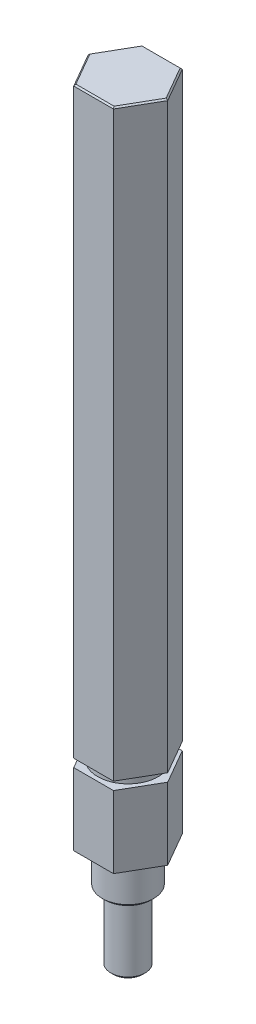
ISO-10303-21;
HEADER;
FILE_DESCRIPTION(('STEP AP214'),'2;1');
FILE_NAME('part.step','',(''),(''),'','','');
FILE_SCHEMA(('AUTOMOTIVE_DESIGN { 1 0 10303 214 1 1 1 1 }'));
ENDSEC;
DATA;
#1=APPLICATION_CONTEXT('core data for automotive mechanical design processes');
#2=APPLICATION_PROTOCOL_DEFINITION('international standard','automotive_design',2000,#1);
#3=PRODUCT_CONTEXT('',#1,'mechanical');
#4=PRODUCT('Part','Part','',(#3));
#5=PRODUCT_RELATED_PRODUCT_CATEGORY('part','',(#4));
#6=PRODUCT_DEFINITION_FORMATION('','',#4);
#7=PRODUCT_DEFINITION_CONTEXT('part definition',#1,'design');
#8=PRODUCT_DEFINITION('design','',#6,#7);
#9=PRODUCT_DEFINITION_SHAPE('','',#8);
#10=(LENGTH_UNIT() NAMED_UNIT(*) SI_UNIT(.MILLI.,.METRE.));
#11=(NAMED_UNIT(*) PLANE_ANGLE_UNIT() SI_UNIT($,.RADIAN.));
#12=(NAMED_UNIT(*) SI_UNIT($,.STERADIAN.) SOLID_ANGLE_UNIT());
#13=UNCERTAINTY_MEASURE_WITH_UNIT(LENGTH_MEASURE(1.E-05),#10,'distance_accuracy_value','');
#14=(GEOMETRIC_REPRESENTATION_CONTEXT(3) GLOBAL_UNCERTAINTY_ASSIGNED_CONTEXT((#13)) GLOBAL_UNIT_ASSIGNED_CONTEXT((#10,
#11,#12)) REPRESENTATION_CONTEXT('',''));
#15=CARTESIAN_POINT('',(0.,0.,0.));
#16=DIRECTION('',(0.,0.,1.));
#17=DIRECTION('',(1.,0.,0.));
#18=AXIS2_PLACEMENT_3D('',#15,#16,#17);
#19=CARTESIAN_POINT('',(-38.3071337161431,-45.212,-16.669011646302));
#20=DIRECTION('',(0.,1.,0.));
#21=DIRECTION('',(0.,0.,1.));
#22=AXIS2_PLACEMENT_3D('',#19,#20,#21);
#23=PLANE('',#22);
#24=CARTESIAN_POINT('',(-38.3071337161431,-45.2119999999923,-16.669011646302));
#25=DIRECTION('',(0.,1.,0.));
#26=DIRECTION('',(0.,0.,1.));
#27=AXIS2_PLACEMENT_3D('',#24,#25,#26);
#28=CIRCLE('',#27,2.65430000009029);
#29=CARTESIAN_POINT('',(-38.3071337161431,-45.2119999999923,-14.0147116462117));
#30=VERTEX_POINT('',#29);
#31=EDGE_CURVE('E20',#30,#30,#28,.T.);
#32=ORIENTED_EDGE('',*,*,#31,.F.);
#33=EDGE_LOOP('',(#32));
#34=FACE_BOUND('',#33,.T.);
#35=ADVANCED_FACE('F17',(#34),#23,.F.);
#36=CARTESIAN_POINT('',(-38.3071337161431,-44.704000000138,-16.669011646302));
#37=DIRECTION('',(0.,1.,0.));
#38=DIRECTION('',(0.,0.,1.));
#39=AXIS2_PLACEMENT_3D('',#36,#37,#38);
#40=CONICAL_SURFACE('',#39,3.16229999994458,0.785398163397448);
#41=CARTESIAN_POINT('',(-38.3071337161431,-44.704,-16.669011646302));
#42=DIRECTION('',(0.,1.,0.));
#43=DIRECTION('',(0.,0.,1.));
#44=AXIS2_PLACEMENT_3D('',#41,#42,#43);
#45=CIRCLE('',#44,3.1623);
#46=CARTESIAN_POINT('',(-38.3071337161431,-44.704,-13.506711646302));
#47=VERTEX_POINT('',#46);
#48=EDGE_CURVE('E154',#47,#47,#45,.T.);
#49=ORIENTED_EDGE('',*,*,#48,.F.);
#50=EDGE_LOOP('',(#49));
#51=FACE_BOUND('',#50,.T.);
#52=ORIENTED_EDGE('',*,*,#31,.T.);
#53=EDGE_LOOP('',(#52));
#54=FACE_BOUND('',#53,.T.);
#55=ADVANCED_FACE('F190',(#51,#54),#40,.T.);
#56=CARTESIAN_POINT('',(-38.3071337161431,-45.212,-16.669011646302));
#57=DIRECTION('',(0.,1.,0.));
#58=DIRECTION('',(0.,0.,1.));
#59=AXIS2_PLACEMENT_3D('',#56,#57,#58);
#60=CYLINDRICAL_SURFACE('',#59,3.1623);
#61=CARTESIAN_POINT('',(-38.3071337161431,-32.512,-16.669011646302));
#62=DIRECTION('',(0.,1.,0.));
#63=DIRECTION('',(0.,0.,1.));
#64=AXIS2_PLACEMENT_3D('',#61,#62,#63);
#65=CIRCLE('',#64,3.1623);
#66=CARTESIAN_POINT('',(-38.3071337161431,-32.512,-13.506711646302));
#67=VERTEX_POINT('',#66);
#68=EDGE_CURVE('E157',#67,#67,#65,.F.);
#69=ORIENTED_EDGE('',*,*,#68,.T.);
#70=EDGE_LOOP('',(#69));
#71=FACE_BOUND('',#70,.T.);
#72=ORIENTED_EDGE('',*,*,#48,.T.);
#73=EDGE_LOOP('',(#72));
#74=FACE_BOUND('',#73,.T.);
#75=ADVANCED_FACE('F174',(#71,#74),#60,.T.);
#76=CARTESIAN_POINT('',(-38.3071337161431,-32.512,-16.669011646302));
#77=DIRECTION('',(0.,1.,0.));
#78=DIRECTION('',(0.,0.,1.));
#79=AXIS2_PLACEMENT_3D('',#76,#77,#78);
#80=PLANE('',#79);
#81=CARTESIAN_POINT('',(-38.3071337161431,-32.511999999997,-16.669011646302));
#82=DIRECTION('',(0.,1.,0.));
#83=DIRECTION('',(0.,0.,1.));
#84=AXIS2_PLACEMENT_3D('',#81,#82,#83);
#85=CIRCLE('',#84,4.24179999994759);
#86=CARTESIAN_POINT('',(-38.3071337161431,-32.511999999997,-12.4272116463544));
#87=VERTEX_POINT('',#86);
#88=EDGE_CURVE('E153',#87,#87,#85,.T.);
#89=ORIENTED_EDGE('',*,*,#88,.F.);
#90=EDGE_LOOP('',(#89));
#91=FACE_BOUND('',#90,.T.);
#92=ORIENTED_EDGE('',*,*,#68,.F.);
#93=EDGE_LOOP('',(#92));
#94=FACE_BOUND('',#93,.T.);
#95=ADVANCED_FACE('F177',(#91,#94),#80,.F.);
#96=CARTESIAN_POINT('',(-38.3071337161431,-32.0039999999722,-16.669011646302));
#97=DIRECTION('',(0.,1.,0.));
#98=DIRECTION('',(0.,0.,1.));
#99=AXIS2_PLACEMENT_3D('',#96,#97,#98);
#100=CONICAL_SURFACE('',#99,4.74979999991557,0.7853981633415);
#101=CARTESIAN_POINT('',(-38.3071337161431,-32.004,-16.669011646302));
#102=DIRECTION('',(0.,1.,0.));
#103=DIRECTION('',(0.,0.,1.));
#104=AXIS2_PLACEMENT_3D('',#101,#102,#103);
#105=CIRCLE('',#104,4.7498);
#106=CARTESIAN_POINT('',(-38.3071337161431,-32.004,-11.919211646302));
#107=VERTEX_POINT('',#106);
#108=EDGE_CURVE('E150',#107,#107,#105,.T.);
#109=ORIENTED_EDGE('',*,*,#108,.F.);
#110=EDGE_LOOP('',(#109));
#111=FACE_BOUND('',#110,.T.);
#112=ORIENTED_EDGE('',*,*,#88,.T.);
#113=EDGE_LOOP('',(#112));
#114=FACE_BOUND('',#113,.T.);
#115=ADVANCED_FACE('F179',(#111,#114),#100,.T.);
#116=CARTESIAN_POINT('',(-38.3071337161431,-32.512,-16.669011646302));
#117=DIRECTION('',(0.,1.,0.));
#118=DIRECTION('',(0.,0.,1.));
#119=AXIS2_PLACEMENT_3D('',#116,#117,#118);
#120=CYLINDRICAL_SURFACE('',#119,4.7498);
#121=CARTESIAN_POINT('',(-38.3071337161431,-25.4,-16.669011646302));
#122=DIRECTION('',(0.,1.,0.));
#123=DIRECTION('',(0.,0.,1.));
#124=AXIS2_PLACEMENT_3D('',#121,#122,#123);
#125=CIRCLE('',#124,4.7498);
#126=CARTESIAN_POINT('',(-38.3071337161431,-25.4,-11.919211646302));
#127=VERTEX_POINT('',#126);
#128=EDGE_CURVE('E132',#127,#127,#125,.F.);
#129=ORIENTED_EDGE('',*,*,#128,.T.);
#130=EDGE_LOOP('',(#129));
#131=FACE_BOUND('',#130,.T.);
#132=ORIENTED_EDGE('',*,*,#108,.T.);
#133=EDGE_LOOP('',(#132));
#134=FACE_BOUND('',#133,.T.);
#135=ADVANCED_FACE('F187',(#131,#134),#120,.T.);
#136=CARTESIAN_POINT('',(-38.3071337161431,-25.4,-3.96901164630201));
#137=DIRECTION('',(0.,1.,0.));
#138=DIRECTION('',(0.,0.,1.));
#139=AXIS2_PLACEMENT_3D('',#136,#137,#138);
#140=PLANE('',#139);
#141=DIRECTION('',(-0.5,0.,0.866025403784439));
#142=VECTOR('',#141,1.);
#143=CARTESIAN_POINT('',(-41.9733079254973,-25.4,-23.019011646302));
#144=LINE('',#143,#142);
#145=CARTESIAN_POINT('',(-41.9733079254973,-25.4,-23.019011646302));
#146=VERTEX_POINT('',#145);
#147=CARTESIAN_POINT('',(-45.6394821348514,-25.4,-16.669011646302));
#148=VERTEX_POINT('',#147);
#149=EDGE_CURVE('E124',#146,#148,#144,.T.);
#150=ORIENTED_EDGE('',*,*,#149,.F.);
#151=DIRECTION('',(-1.,0.,0.));
#152=VECTOR('',#151,1.);
#153=CARTESIAN_POINT('',(-34.640959506789,-25.4,-23.019011646302));
#154=LINE('',#153,#152);
#155=CARTESIAN_POINT('',(-34.640959506789,-25.4,-23.019011646302));
#156=VERTEX_POINT('',#155);
#157=EDGE_CURVE('E121',#156,#146,#154,.T.);
#158=ORIENTED_EDGE('',*,*,#157,.F.);
#159=DIRECTION('',(-0.5,0.,-0.866025403784439));
#160=VECTOR('',#159,1.);
#161=CARTESIAN_POINT('',(-30.9747852974349,-25.4,-16.669011646302));
#162=LINE('',#161,#160);
#163=CARTESIAN_POINT('',(-30.9747852974349,-25.4,-16.669011646302));
#164=VERTEX_POINT('',#163);
#165=EDGE_CURVE('E141',#164,#156,#162,.T.);
#166=ORIENTED_EDGE('',*,*,#165,.F.);
#167=DIRECTION('',(0.500000000000001,0.,-0.866025403784438));
#168=VECTOR('',#167,1.);
#169=CARTESIAN_POINT('',(-34.640959506789,-25.4,-10.319011646302));
#170=LINE('',#169,#168);
#171=CARTESIAN_POINT('',(-34.640959506789,-25.4,-10.319011646302));
#172=VERTEX_POINT('',#171);
#173=EDGE_CURVE('E478',#172,#164,#170,.T.);
#174=ORIENTED_EDGE('',*,*,#173,.F.);
#175=DIRECTION('',(1.,0.,0.));
#176=VECTOR('',#175,1.);
#177=CARTESIAN_POINT('',(-41.9733079254973,-25.4,-10.319011646302));
#178=LINE('',#177,#176);
#179=CARTESIAN_POINT('',(-41.9733079254973,-25.4,-10.319011646302));
#180=VERTEX_POINT('',#179);
#181=EDGE_CURVE('E483',#180,#172,#178,.T.);
#182=ORIENTED_EDGE('',*,*,#181,.F.);
#183=DIRECTION('',(0.5,0.,0.866025403784439));
#184=VECTOR('',#183,1.);
#185=CARTESIAN_POINT('',(-45.6394821348514,-25.4,-16.669011646302));
#186=LINE('',#185,#184);
#187=EDGE_CURVE('E129',#148,#180,#186,.T.);
#188=ORIENTED_EDGE('',*,*,#187,.F.);
#189=EDGE_LOOP('',(#150,#158,#166,#174,#182,#188));
#190=FACE_BOUND('',#189,.T.);
#191=ORIENTED_EDGE('',*,*,#128,.F.);
#192=EDGE_LOOP('',(#191));
#193=FACE_BOUND('',#192,.T.);
#194=ADVANCED_FACE('F126',(#190,#193),#140,.F.);
#195=CARTESIAN_POINT('',(-41.9733079254973,-25.4,-23.019011646302));
#196=DIRECTION('',(-0.866025403784439,0.,-0.5));
#197=DIRECTION('',(-0.5,0.,0.866025403784439));
#198=AXIS2_PLACEMENT_3D('',#195,#196,#197);
#199=PLANE('',#198);
#200=ORIENTED_EDGE('',*,*,#149,.T.);
#201=DIRECTION('',(0.,1.,0.));
#202=VECTOR('',#201,1.);
#203=CARTESIAN_POINT('',(-45.6394821348514,-25.4,-16.669011646302));
#204=LINE('',#203,#202);
#205=CARTESIAN_POINT('',(-45.6394821348514,-12.1158,-16.669011646302));
#206=VERTEX_POINT('',#205);
#207=EDGE_CURVE('E489',#206,#148,#204,.F.);
#208=ORIENTED_EDGE('',*,*,#207,.F.);
#209=DIRECTION('',(0.5,0.,-0.866025403784439));
#210=VECTOR('',#209,1.);
#211=CARTESIAN_POINT('',(-45.6394821348514,-12.1158,-16.669011646302));
#212=LINE('',#211,#210);
#213=CARTESIAN_POINT('',(-41.9733079254973,-12.1158,-23.019011646302));
#214=VERTEX_POINT('',#213);
#215=EDGE_CURVE('E138',#206,#214,#212,.T.);
#216=ORIENTED_EDGE('',*,*,#215,.T.);
#217=DIRECTION('',(0.,1.,0.));
#218=VECTOR('',#217,1.);
#219=CARTESIAN_POINT('',(-41.9733079254973,-25.4,-23.019011646302));
#220=LINE('',#219,#218);
#221=EDGE_CURVE('E135',#146,#214,#220,.T.);
#222=ORIENTED_EDGE('',*,*,#221,.F.);
#223=EDGE_LOOP('',(#200,#208,#216,#222));
#224=FACE_BOUND('',#223,.T.);
#225=ADVANCED_FACE('F136',(#224),#199,.T.);
#226=CARTESIAN_POINT('',(-34.640959506789,-25.4,-23.019011646302));
#227=DIRECTION('',(0.,0.,-1.));
#228=DIRECTION('',(-1.,0.,0.));
#229=AXIS2_PLACEMENT_3D('',#226,#227,#228);
#230=PLANE('',#229);
#231=ORIENTED_EDGE('',*,*,#157,.T.);
#232=ORIENTED_EDGE('',*,*,#221,.T.);
#233=DIRECTION('',(1.,0.,0.));
#234=VECTOR('',#233,1.);
#235=CARTESIAN_POINT('',(-21.7881364409388,-12.1158,-23.019011646302));
#236=LINE('',#235,#234);
#237=CARTESIAN_POINT('',(-34.640959506789,-12.1158,-23.019011646302));
#238=VERTEX_POINT('',#237);
#239=EDGE_CURVE('E500',#214,#238,#236,.T.);
#240=ORIENTED_EDGE('',*,*,#239,.T.);
#241=DIRECTION('',(0.,1.,0.));
#242=VECTOR('',#241,1.);
#243=CARTESIAN_POINT('',(-34.640959506789,-25.4,-23.019011646302));
#244=LINE('',#243,#242);
#245=EDGE_CURVE('E145',#156,#238,#244,.T.);
#246=ORIENTED_EDGE('',*,*,#245,.F.);
#247=EDGE_LOOP('',(#231,#232,#240,#246));
#248=FACE_BOUND('',#247,.T.);
#249=ADVANCED_FACE('F143',(#248),#230,.T.);
#250=CARTESIAN_POINT('',(-30.9747852974349,-25.4,-16.669011646302));
#251=DIRECTION('',(0.866025403784439,0.,-0.5));
#252=DIRECTION('',(-0.5,0.,-0.866025403784439));
#253=AXIS2_PLACEMENT_3D('',#250,#251,#252);
#254=PLANE('',#253);
#255=ORIENTED_EDGE('',*,*,#165,.T.);
#256=ORIENTED_EDGE('',*,*,#245,.T.);
#257=DIRECTION('',(0.5,0.,0.866025403784438));
#258=VECTOR('',#257,1.);
#259=CARTESIAN_POINT('',(-34.640959506789,-12.1158,-23.019011646302));
#260=LINE('',#259,#258);
#261=CARTESIAN_POINT('',(-30.9747852974349,-12.1158,-16.669011646302));
#262=VERTEX_POINT('',#261);
#263=EDGE_CURVE('E502',#238,#262,#260,.T.);
#264=ORIENTED_EDGE('',*,*,#263,.T.);
#265=DIRECTION('',(0.,1.,0.));
#266=VECTOR('',#265,1.);
#267=CARTESIAN_POINT('',(-30.9747852974349,-25.4,-16.669011646302));
#268=LINE('',#267,#266);
#269=EDGE_CURVE('E476',#164,#262,#268,.T.);
#270=ORIENTED_EDGE('',*,*,#269,.F.);
#271=EDGE_LOOP('',(#255,#256,#264,#270));
#272=FACE_BOUND('',#271,.T.);
#273=ADVANCED_FACE('F271',(#272),#254,.T.);
#274=CARTESIAN_POINT('',(-34.640959506789,-25.4,-10.319011646302));
#275=DIRECTION('',(0.866025403784438,0.,0.500000000000001));
#276=DIRECTION('',(0.500000000000001,0.,-0.866025403784438));
#277=AXIS2_PLACEMENT_3D('',#274,#275,#276);
#278=PLANE('',#277);
#279=ORIENTED_EDGE('',*,*,#173,.T.);
#280=ORIENTED_EDGE('',*,*,#269,.T.);
#281=DIRECTION('',(-0.500000000000001,0.,0.866025403784438));
#282=VECTOR('',#281,1.);
#283=CARTESIAN_POINT('',(-30.9747852974349,-12.1158,-16.669011646302));
#284=LINE('',#283,#282);
#285=CARTESIAN_POINT('',(-34.640959506789,-12.1158,-10.319011646302));
#286=VERTEX_POINT('',#285);
#287=EDGE_CURVE('E504',#262,#286,#284,.T.);
#288=ORIENTED_EDGE('',*,*,#287,.T.);
#289=DIRECTION('',(0.,1.,0.));
#290=VECTOR('',#289,1.);
#291=CARTESIAN_POINT('',(-34.640959506789,-25.4,-10.319011646302));
#292=LINE('',#291,#290);
#293=EDGE_CURVE('E486',#172,#286,#292,.T.);
#294=ORIENTED_EDGE('',*,*,#293,.F.);
#295=EDGE_LOOP('',(#279,#280,#288,#294));
#296=FACE_BOUND('',#295,.T.);
#297=ADVANCED_FACE('F267',(#296),#278,.T.);
#298=CARTESIAN_POINT('',(-41.9733079254973,-25.4,-10.319011646302));
#299=DIRECTION('',(0.,0.,1.));
#300=DIRECTION('',(1.,0.,0.));
#301=AXIS2_PLACEMENT_3D('',#298,#299,#300);
#302=PLANE('',#301);
#303=ORIENTED_EDGE('',*,*,#181,.T.);
#304=ORIENTED_EDGE('',*,*,#293,.T.);
#305=DIRECTION('',(1.,0.,0.));
#306=VECTOR('',#305,1.);
#307=CARTESIAN_POINT('',(-21.7881364409388,-12.1158,-10.319011646302));
#308=LINE('',#307,#306);
#309=CARTESIAN_POINT('',(-41.9733079254973,-12.1158,-10.319011646302));
#310=VERTEX_POINT('',#309);
#311=EDGE_CURVE('E506',#286,#310,#308,.F.);
#312=ORIENTED_EDGE('',*,*,#311,.T.);
#313=DIRECTION('',(0.,1.,0.));
#314=VECTOR('',#313,1.);
#315=CARTESIAN_POINT('',(-41.9733079254973,-25.4,-10.319011646302));
#316=LINE('',#315,#314);
#317=EDGE_CURVE('E492',#180,#310,#316,.T.);
#318=ORIENTED_EDGE('',*,*,#317,.F.);
#319=EDGE_LOOP('',(#303,#304,#312,#318));
#320=FACE_BOUND('',#319,.T.);
#321=ADVANCED_FACE('F263',(#320),#302,.T.);
#322=CARTESIAN_POINT('',(-45.6394821348514,-25.4,-16.669011646302));
#323=DIRECTION('',(-0.866025403784439,0.,0.5));
#324=DIRECTION('',(0.5,0.,0.866025403784439));
#325=AXIS2_PLACEMENT_3D('',#322,#323,#324);
#326=PLANE('',#325);
#327=ORIENTED_EDGE('',*,*,#187,.T.);
#328=ORIENTED_EDGE('',*,*,#317,.T.);
#329=DIRECTION('',(-0.5,0.,-0.866025403784438));
#330=VECTOR('',#329,1.);
#331=CARTESIAN_POINT('',(-41.9733079254973,-12.1158,-10.319011646302));
#332=LINE('',#331,#330);
#333=EDGE_CURVE('E508',#310,#206,#332,.T.);
#334=ORIENTED_EDGE('',*,*,#333,.T.);
#335=ORIENTED_EDGE('',*,*,#207,.T.);
#336=EDGE_LOOP('',(#327,#328,#334,#335));
#337=FACE_BOUND('',#336,.T.);
#338=ADVANCED_FACE('F259',(#337),#326,.T.);
#339=CARTESIAN_POINT('',(-38.3071337161451,97.0813400000005,-10.573011646302));
#340=DIRECTION('',(0.,-0.707106781186544,-0.707106781186551));
#341=DIRECTION('',(0.,0.707106781186551,-0.707106781186544));
#342=AXIS2_PLACEMENT_3D('',#339,#340,#341);
#343=PLANE('',#342);
#344=DIRECTION('',(1.,0.,0.));
#345=VECTOR('',#344,1.);
#346=CARTESIAN_POINT('',(-41.9733079254973,96.8273400000005,-10.319011646302));
#347=LINE('',#346,#345);
#348=CARTESIAN_POINT('',(-34.640959506789,96.8273400000005,-10.319011646302));
#349=VERTEX_POINT('',#348);
#350=CARTESIAN_POINT('',(-41.9733079254973,96.8273400000005,-10.319011646302));
#351=VERTEX_POINT('',#350);
#352=EDGE_CURVE('E531',#349,#351,#347,.F.);
#353=ORIENTED_EDGE('',*,*,#352,.F.);
#354=DIRECTION('',(-0.377964473009223,0.654653670707976,-0.654653670707981));
#355=VECTOR('',#354,1.);
#356=CARTESIAN_POINT('',(-34.640959506789,96.8273400000005,-10.319011646302));
#357=LINE('',#356,#355);
#358=CARTESIAN_POINT('',(-34.7876064751632,97.0813400000005,-10.573011646302));
#359=VERTEX_POINT('',#358);
#360=EDGE_CURVE('E495',#349,#359,#357,.T.);
#361=ORIENTED_EDGE('',*,*,#360,.T.);
#362=DIRECTION('',(1.,0.,0.));
#363=VECTOR('',#362,1.);
#364=CARTESIAN_POINT('',(-38.3071337161451,97.0813400000005,-10.573011646302));
#365=LINE('',#364,#363);
#366=CARTESIAN_POINT('',(-41.8266609571231,97.0813400000005,-10.573011646302));
#367=VERTEX_POINT('',#366);
#368=EDGE_CURVE('E518',#367,#359,#365,.T.);
#369=ORIENTED_EDGE('',*,*,#368,.F.);
#370=DIRECTION('',(-0.377964473009255,-0.654653670707976,0.654653670707962));
#371=VECTOR('',#370,1.);
#372=CARTESIAN_POINT('',(-41.8266609571231,97.0813400000005,-10.573011646302));
#373=LINE('',#372,#371);
#374=EDGE_CURVE('E511',#367,#351,#373,.T.);
#375=ORIENTED_EDGE('',*,*,#374,.T.);
#376=EDGE_LOOP('',(#353,#361,#369,#375));
#377=FACE_BOUND('',#376,.T.);
#378=ADVANCED_FACE('F255',(#377),#343,.F.);
#379=CARTESIAN_POINT('',(-33.0278428546734,97.0813400000005,-13.6210116463016));
#380=DIRECTION('',(-0.612372435695796,-0.707106781186546,-0.353553390593275));
#381=DIRECTION('',(0.755928946018453,-0.654653670707979,0.));
#382=AXIS2_PLACEMENT_3D('',#379,#380,#381);
#383=PLANE('',#382);
#384=DIRECTION('',(0.500000000000001,0.,-0.866025403784438));
#385=VECTOR('',#384,1.);
#386=CARTESIAN_POINT('',(-34.7876064751632,97.0813400000005,-10.573011646302));
#387=LINE('',#386,#385);
#388=CARTESIAN_POINT('',(-31.2680792341832,97.0813400000005,-16.669011646302));
#389=VERTEX_POINT('',#388);
#390=EDGE_CURVE('E521',#359,#389,#387,.T.);
#391=ORIENTED_EDGE('',*,*,#390,.F.);
#392=ORIENTED_EDGE('',*,*,#360,.F.);
#393=DIRECTION('',(0.500000000000001,0.,-0.866025403784438));
#394=VECTOR('',#393,1.);
#395=CARTESIAN_POINT('',(-34.640959506789,96.8273400000005,-10.319011646302));
#396=LINE('',#395,#394);
#397=CARTESIAN_POINT('',(-30.9747852974349,96.8273400000005,-16.669011646302));
#398=VERTEX_POINT('',#397);
#399=EDGE_CURVE('E534',#398,#349,#396,.F.);
#400=ORIENTED_EDGE('',*,*,#399,.F.);
#401=DIRECTION('',(0.755928946018445,-0.654653670707988,0.));
#402=VECTOR('',#401,1.);
#403=CARTESIAN_POINT('',(-32.2736584458922,97.952197142858,-16.669011646302));
#404=LINE('',#403,#402);
#405=EDGE_CURVE('E497',#398,#389,#404,.F.);
#406=ORIENTED_EDGE('',*,*,#405,.T.);
#407=EDGE_LOOP('',(#391,#392,#400,#406));
#408=FACE_BOUND('',#407,.T.);
#409=ADVANCED_FACE('F251',(#408),#383,.F.);
#410=CARTESIAN_POINT('',(-33.0278428546739,97.0813400000005,-19.7170116463033));
#411=DIRECTION('',(-0.612372435695803,-0.707106781186538,0.353553390593279));
#412=DIRECTION('',(0.755928946018445,-0.654653670707988,0.));
#413=AXIS2_PLACEMENT_3D('',#410,#411,#412);
#414=PLANE('',#413);
#415=DIRECTION('',(-0.5,0.,-0.866025403784439));
#416=VECTOR('',#415,1.);
#417=CARTESIAN_POINT('',(-31.2680792341832,97.0813400000005,-16.669011646302));
#418=LINE('',#417,#416);
#419=CARTESIAN_POINT('',(-34.7876064751632,97.0813400000005,-22.765011646302));
#420=VERTEX_POINT('',#419);
#421=EDGE_CURVE('E524',#389,#420,#418,.T.);
#422=ORIENTED_EDGE('',*,*,#421,.F.);
#423=ORIENTED_EDGE('',*,*,#405,.F.);
#424=DIRECTION('',(-0.5,0.,-0.866025403784439));
#425=VECTOR('',#424,1.);
#426=CARTESIAN_POINT('',(-30.9747852974349,96.8273400000005,-16.669011646302));
#427=LINE('',#426,#425);
#428=CARTESIAN_POINT('',(-34.640959506789,96.8273400000005,-23.019011646302));
#429=VERTEX_POINT('',#428);
#430=EDGE_CURVE('E540',#429,#398,#427,.F.);
#431=ORIENTED_EDGE('',*,*,#430,.F.);
#432=DIRECTION('',(-0.377964473009211,0.654653670707982,0.654653670707982));
#433=VECTOR('',#432,1.);
#434=CARTESIAN_POINT('',(-34.640959506789,96.8273400000005,-23.019011646302));
#435=LINE('',#434,#433);
#436=EDGE_CURVE('E528',#429,#420,#435,.T.);
#437=ORIENTED_EDGE('',*,*,#436,.T.);
#438=EDGE_LOOP('',(#422,#423,#431,#437));
#439=FACE_BOUND('',#438,.T.);
#440=ADVANCED_FACE('F247',(#439),#414,.F.);
#441=CARTESIAN_POINT('',(-21.7881364409388,-12.1158,-16.669011646302));
#442=DIRECTION('',(0.,-1.,0.));
#443=DIRECTION('',(0.,0.,-1.));
#444=AXIS2_PLACEMENT_3D('',#441,#442,#443);
#445=PLANE('',#444);
#446=ORIENTED_EDGE('',*,*,#311,.F.);
#447=ORIENTED_EDGE('',*,*,#287,.F.);
#448=ORIENTED_EDGE('',*,*,#263,.F.);
#449=ORIENTED_EDGE('',*,*,#239,.F.);
#450=ORIENTED_EDGE('',*,*,#215,.F.);
#451=ORIENTED_EDGE('',*,*,#333,.F.);
#452=EDGE_LOOP('',(#446,#447,#448,#449,#450,#451));
#453=FACE_BOUND('',#452,.T.);
#454=CARTESIAN_POINT('',(-38.3071337161431,-12.1158,-16.669011646302));
#455=DIRECTION('',(0.,1.,0.));
#456=DIRECTION('',(0.,0.,1.));
#457=AXIS2_PLACEMENT_3D('',#454,#455,#456);
#458=CIRCLE('',#457,5.58800000000003);
#459=CARTESIAN_POINT('',(-38.3071337161431,-12.1158,-11.081011646302));
#460=VERTEX_POINT('',#459);
#461=EDGE_CURVE('E163',#460,#460,#458,.T.);
#462=ORIENTED_EDGE('',*,*,#461,.F.);
#463=EDGE_LOOP('',(#462));
#464=FACE_BOUND('',#463,.T.);
#465=ADVANCED_FACE('F243',(#453,#464),#445,.F.);
#466=CARTESIAN_POINT('',(-43.5864245776138,97.0813400000005,-13.6210116463033));
#467=DIRECTION('',(0.612372435695786,-0.707106781186557,-0.353553390593269));
#468=DIRECTION('',(0.755928946018463,0.654653670707967,0.));
#469=AXIS2_PLACEMENT_3D('',#466,#467,#468);
#470=PLANE('',#469);
#471=DIRECTION('',(0.5,0.,0.866025403784439));
#472=VECTOR('',#471,1.);
#473=CARTESIAN_POINT('',(-45.6394821348514,96.8273400000005,-16.669011646302));
#474=LINE('',#473,#472);
#475=CARTESIAN_POINT('',(-45.6394821348514,96.8273400000005,-16.669011646302));
#476=VERTEX_POINT('',#475);
#477=EDGE_CURVE('E547',#351,#476,#474,.F.);
#478=ORIENTED_EDGE('',*,*,#477,.F.);
#479=ORIENTED_EDGE('',*,*,#374,.F.);
#480=DIRECTION('',(0.5,0.,0.866025403784439));
#481=VECTOR('',#480,1.);
#482=CARTESIAN_POINT('',(-45.3461881981031,97.0813400000005,-16.669011646302));
#483=LINE('',#482,#481);
#484=CARTESIAN_POINT('',(-45.346188198103,97.0813400000005,-16.669011646302));
#485=VERTEX_POINT('',#484);
#486=EDGE_CURVE('E515',#485,#367,#483,.T.);
#487=ORIENTED_EDGE('',*,*,#486,.F.);
#488=DIRECTION('',(0.755928946018463,0.654653670707967,0.));
#489=VECTOR('',#488,1.);
#490=CARTESIAN_POINT('',(-44.3406089863949,97.9521971428572,-16.669011646302));
#491=LINE('',#490,#489);
#492=EDGE_CURVE('E513',#476,#485,#491,.T.);
#493=ORIENTED_EDGE('',*,*,#492,.F.);
#494=EDGE_LOOP('',(#478,#479,#487,#493));
#495=FACE_BOUND('',#494,.T.);
#496=ADVANCED_FACE('F239',(#495),#470,.F.);
#497=CARTESIAN_POINT('',(-38.3071337161451,97.0813400000005,-16.6690116463026));
#498=DIRECTION('',(0.,1.,0.));
#499=DIRECTION('',(0.,0.,1.));
#500=AXIS2_PLACEMENT_3D('',#497,#498,#499);
#501=PLANE('',#500);
#502=DIRECTION('',(1.,0.,0.));
#503=VECTOR('',#502,1.);
#504=CARTESIAN_POINT('',(-38.3071337161451,97.0813400000005,-22.765011646302));
#505=LINE('',#504,#503);
#506=CARTESIAN_POINT('',(-41.8266609571231,97.0813400000005,-22.765011646302));
#507=VERTEX_POINT('',#506);
#508=EDGE_CURVE('E526',#420,#507,#505,.F.);
#509=ORIENTED_EDGE('',*,*,#508,.T.);
#510=DIRECTION('',(-0.500000000000001,0.,0.866025403784438));
#511=VECTOR('',#510,1.);
#512=CARTESIAN_POINT('',(-41.8266609571231,97.0813400000005,-22.765011646302));
#513=LINE('',#512,#511);
#514=EDGE_CURVE('E550',#507,#485,#513,.T.);
#515=ORIENTED_EDGE('',*,*,#514,.T.);
#516=ORIENTED_EDGE('',*,*,#486,.T.);
#517=ORIENTED_EDGE('',*,*,#368,.T.);
#518=ORIENTED_EDGE('',*,*,#390,.T.);
#519=ORIENTED_EDGE('',*,*,#421,.T.);
#520=EDGE_LOOP('',(#509,#515,#516,#517,#518,#519));
#521=FACE_BOUND('',#520,.T.);
#522=ADVANCED_FACE('F235',(#521),#501,.T.);
#523=CARTESIAN_POINT('',(-38.3071337161451,97.0813400000005,-22.765011646302));
#524=DIRECTION('',(0.,-0.707106781186551,0.707106781186544));
#525=DIRECTION('',(0.,-0.707106781186544,-0.707106781186551));
#526=AXIS2_PLACEMENT_3D('',#523,#524,#525);
#527=PLANE('',#526);
#528=DIRECTION('',(-1.,0.,0.));
#529=VECTOR('',#528,1.);
#530=CARTESIAN_POINT('',(-34.640959506789,96.8273400000005,-23.019011646302));
#531=LINE('',#530,#529);
#532=CARTESIAN_POINT('',(-41.9733079254973,96.8273400000005,-23.019011646302));
#533=VERTEX_POINT('',#532);
#534=EDGE_CURVE('E556',#533,#429,#531,.F.);
#535=ORIENTED_EDGE('',*,*,#534,.F.);
#536=DIRECTION('',(0.377964473009259,0.654653670707977,0.654653670707959));
#537=VECTOR('',#536,1.);
#538=CARTESIAN_POINT('',(-41.9733079254973,96.8273400000005,-23.019011646302));
#539=LINE('',#538,#537);
#540=EDGE_CURVE('E553',#533,#507,#539,.T.);
#541=ORIENTED_EDGE('',*,*,#540,.T.);
#542=ORIENTED_EDGE('',*,*,#508,.F.);
#543=ORIENTED_EDGE('',*,*,#436,.F.);
#544=EDGE_LOOP('',(#535,#541,#542,#543));
#545=FACE_BOUND('',#544,.T.);
#546=ADVANCED_FACE('F231',(#545),#527,.F.);
#547=CARTESIAN_POINT('',(-41.9733079254973,-25.4,-10.319011646302));
#548=DIRECTION('',(0.,0.,1.));
#549=DIRECTION('',(1.,0.,0.));
#550=AXIS2_PLACEMENT_3D('',#547,#548,#549);
#551=PLANE('',#550);
#552=DIRECTION('',(0.,1.,0.));
#553=VECTOR('',#552,1.);
#554=CARTESIAN_POINT('',(-41.9733079254973,-25.4,-10.319011646302));
#555=LINE('',#554,#553);
#556=CARTESIAN_POINT('',(-41.9733079254973,-10.6172,-10.319011646302));
#557=VERTEX_POINT('',#556);
#558=EDGE_CURVE('E166',#557,#351,#555,.T.);
#559=ORIENTED_EDGE('',*,*,#558,.F.);
#560=DIRECTION('',(1.,0.,0.));
#561=VECTOR('',#560,1.);
#562=CARTESIAN_POINT('',(-32.7191337161431,-10.6172,-10.319011646302));
#563=LINE('',#562,#561);
#564=CARTESIAN_POINT('',(-34.640959506789,-10.6172,-10.319011646302));
#565=VERTEX_POINT('',#564);
#566=EDGE_CURVE('E565',#557,#565,#563,.T.);
#567=ORIENTED_EDGE('',*,*,#566,.T.);
#568=DIRECTION('',(0.,1.,0.));
#569=VECTOR('',#568,1.);
#570=CARTESIAN_POINT('',(-34.640959506789,-25.4,-10.319011646302));
#571=LINE('',#570,#569);
#572=EDGE_CURVE('E537',#349,#565,#571,.F.);
#573=ORIENTED_EDGE('',*,*,#572,.F.);
#574=ORIENTED_EDGE('',*,*,#352,.T.);
#575=EDGE_LOOP('',(#559,#567,#573,#574));
#576=FACE_BOUND('',#575,.T.);
#577=ADVANCED_FACE('F227',(#576),#551,.T.);
#578=CARTESIAN_POINT('',(-34.640959506789,-25.4,-10.319011646302));
#579=DIRECTION('',(0.866025403784438,0.,0.500000000000001));
#580=DIRECTION('',(0.500000000000001,0.,-0.866025403784438));
#581=AXIS2_PLACEMENT_3D('',#578,#579,#580);
#582=PLANE('',#581);
#583=ORIENTED_EDGE('',*,*,#572,.T.);
#584=DIRECTION('',(0.500000000000001,0.,-0.866025403784438));
#585=VECTOR('',#584,1.);
#586=CARTESIAN_POINT('',(-34.640959506789,-10.6172,-10.319011646302));
#587=LINE('',#586,#585);
#588=CARTESIAN_POINT('',(-30.9747852974349,-10.6172,-16.669011646302));
#589=VERTEX_POINT('',#588);
#590=EDGE_CURVE('E567',#565,#589,#587,.T.);
#591=ORIENTED_EDGE('',*,*,#590,.T.);
#592=DIRECTION('',(0.,1.,0.));
#593=VECTOR('',#592,1.);
#594=CARTESIAN_POINT('',(-30.9747852974349,-25.4,-16.669011646302));
#595=LINE('',#594,#593);
#596=EDGE_CURVE('E167',#398,#589,#595,.F.);
#597=ORIENTED_EDGE('',*,*,#596,.F.);
#598=ORIENTED_EDGE('',*,*,#399,.T.);
#599=EDGE_LOOP('',(#583,#591,#597,#598));
#600=FACE_BOUND('',#599,.T.);
#601=ADVANCED_FACE('F223',(#600),#582,.T.);
#602=CARTESIAN_POINT('',(-30.9747852974349,-25.4,-16.669011646302));
#603=DIRECTION('',(0.866025403784439,0.,-0.5));
#604=DIRECTION('',(-0.5,0.,-0.866025403784439));
#605=AXIS2_PLACEMENT_3D('',#602,#603,#604);
#606=PLANE('',#605);
#607=ORIENTED_EDGE('',*,*,#596,.T.);
#608=DIRECTION('',(-0.5,0.,-0.866025403784438));
#609=VECTOR('',#608,1.);
#610=CARTESIAN_POINT('',(-30.9747852974349,-10.6172,-16.669011646302));
#611=LINE('',#610,#609);
#612=CARTESIAN_POINT('',(-34.640959506789,-10.6172,-23.019011646302));
#613=VERTEX_POINT('',#612);
#614=EDGE_CURVE('E162',#589,#613,#611,.T.);
#615=ORIENTED_EDGE('',*,*,#614,.T.);
#616=DIRECTION('',(0.,1.,0.));
#617=VECTOR('',#616,1.);
#618=CARTESIAN_POINT('',(-34.640959506789,-25.4,-23.019011646302));
#619=LINE('',#618,#617);
#620=EDGE_CURVE('E559',#429,#613,#619,.F.);
#621=ORIENTED_EDGE('',*,*,#620,.F.);
#622=ORIENTED_EDGE('',*,*,#430,.T.);
#623=EDGE_LOOP('',(#607,#615,#621,#622));
#624=FACE_BOUND('',#623,.T.);
#625=ADVANCED_FACE('F219',(#624),#606,.T.);
#626=CARTESIAN_POINT('',(-38.3071337161431,-25.4,-16.669011646302));
#627=DIRECTION('',(0.,1.,0.));
#628=DIRECTION('',(0.,0.,1.));
#629=AXIS2_PLACEMENT_3D('',#626,#627,#628);
#630=CYLINDRICAL_SURFACE('',#629,5.58800000000003);
#631=CARTESIAN_POINT('',(-38.3071337161431,-10.6172,-16.669011646302));
#632=DIRECTION('',(0.,1.,0.));
#633=DIRECTION('',(0.,0.,1.));
#634=AXIS2_PLACEMENT_3D('',#631,#632,#633);
#635=CIRCLE('',#634,5.58800000000003);
#636=CARTESIAN_POINT('',(-38.3071337161431,-10.6172,-11.081011646302));
#637=VERTEX_POINT('',#636);
#638=EDGE_CURVE('E158',#637,#637,#635,.F.);
#639=ORIENTED_EDGE('',*,*,#638,.T.);
#640=EDGE_LOOP('',(#639));
#641=FACE_BOUND('',#640,.T.);
#642=ORIENTED_EDGE('',*,*,#461,.T.);
#643=EDGE_LOOP('',(#642));
#644=FACE_BOUND('',#643,.T.);
#645=ADVANCED_FACE('F215',(#641,#644),#630,.T.);
#646=CARTESIAN_POINT('',(-45.6394821348514,-25.4,-16.669011646302));
#647=DIRECTION('',(-0.866025403784439,0.,0.5));
#648=DIRECTION('',(0.5,0.,0.866025403784439));
#649=AXIS2_PLACEMENT_3D('',#646,#647,#648);
#650=PLANE('',#649);
#651=DIRECTION('',(0.,1.,0.));
#652=VECTOR('',#651,1.);
#653=CARTESIAN_POINT('',(-45.6394821348514,-25.4,-16.669011646302));
#654=LINE('',#653,#652);
#655=CARTESIAN_POINT('',(-45.6394821348514,-10.6172,-16.669011646302));
#656=VERTEX_POINT('',#655);
#657=EDGE_CURVE('E161',#656,#476,#654,.T.);
#658=ORIENTED_EDGE('',*,*,#657,.F.);
#659=DIRECTION('',(0.5,0.,0.866025403784438));
#660=VECTOR('',#659,1.);
#661=CARTESIAN_POINT('',(-45.6394821348514,-10.6172,-16.669011646302));
#662=LINE('',#661,#660);
#663=EDGE_CURVE('E562',#656,#557,#662,.T.);
#664=ORIENTED_EDGE('',*,*,#663,.T.);
#665=ORIENTED_EDGE('',*,*,#558,.T.);
#666=ORIENTED_EDGE('',*,*,#477,.T.);
#667=EDGE_LOOP('',(#658,#664,#665,#666));
#668=FACE_BOUND('',#667,.T.);
#669=ADVANCED_FACE('F211',(#668),#650,.T.);
#670=CARTESIAN_POINT('',(-43.5864245776133,97.0813400000005,-19.7170116463016));
#671=DIRECTION('',(0.612372435695792,-0.70710678118655,0.353553390593273));
#672=DIRECTION('',(0.755928946018457,0.654653670707975,0.));
#673=AXIS2_PLACEMENT_3D('',#670,#671,#672);
#674=PLANE('',#673);
#675=DIRECTION('',(-0.5,0.,0.866025403784439));
#676=VECTOR('',#675,1.);
#677=CARTESIAN_POINT('',(-41.9733079254973,96.8273400000005,-23.019011646302));
#678=LINE('',#677,#676);
#679=EDGE_CURVE('E573',#476,#533,#678,.F.);
#680=ORIENTED_EDGE('',*,*,#679,.F.);
#681=ORIENTED_EDGE('',*,*,#492,.T.);
#682=ORIENTED_EDGE('',*,*,#514,.F.);
#683=ORIENTED_EDGE('',*,*,#540,.F.);
#684=EDGE_LOOP('',(#680,#681,#682,#683));
#685=FACE_BOUND('',#684,.T.);
#686=ADVANCED_FACE('F208',(#685),#674,.F.);
#687=CARTESIAN_POINT('',(-34.640959506789,-25.4,-23.019011646302));
#688=DIRECTION('',(0.,0.,-1.));
#689=DIRECTION('',(-1.,0.,0.));
#690=AXIS2_PLACEMENT_3D('',#687,#688,#689);
#691=PLANE('',#690);
#692=ORIENTED_EDGE('',*,*,#620,.T.);
#693=DIRECTION('',(1.,0.,0.));
#694=VECTOR('',#693,1.);
#695=CARTESIAN_POINT('',(-32.7191337161431,-10.6172,-23.019011646302));
#696=LINE('',#695,#694);
#697=CARTESIAN_POINT('',(-41.9733079254973,-10.6172,-23.019011646302));
#698=VERTEX_POINT('',#697);
#699=EDGE_CURVE('E35',#613,#698,#696,.F.);
#700=ORIENTED_EDGE('',*,*,#699,.T.);
#701=DIRECTION('',(0.,1.,0.));
#702=VECTOR('',#701,1.);
#703=CARTESIAN_POINT('',(-41.9733079254973,-25.4,-23.019011646302));
#704=LINE('',#703,#702);
#705=EDGE_CURVE('E26',#533,#698,#704,.F.);
#706=ORIENTED_EDGE('',*,*,#705,.F.);
#707=ORIENTED_EDGE('',*,*,#534,.T.);
#708=EDGE_LOOP('',(#692,#700,#706,#707));
#709=FACE_BOUND('',#708,.T.);
#710=ADVANCED_FACE('F201',(#709),#691,.T.);
#711=CARTESIAN_POINT('',(-32.7191337161431,-10.6172,-16.669011646302));
#712=DIRECTION('',(0.,1.,0.));
#713=DIRECTION('',(0.,0.,1.));
#714=AXIS2_PLACEMENT_3D('',#711,#712,#713);
#715=PLANE('',#714);
#716=ORIENTED_EDGE('',*,*,#638,.F.);
#717=EDGE_LOOP('',(#716));
#718=FACE_BOUND('',#717,.T.);
#719=ORIENTED_EDGE('',*,*,#590,.F.);
#720=ORIENTED_EDGE('',*,*,#566,.F.);
#721=ORIENTED_EDGE('',*,*,#663,.F.);
#722=DIRECTION('',(-0.5,0.,0.866025403784439));
#723=VECTOR('',#722,1.);
#724=CARTESIAN_POINT('',(-41.9733079254973,-10.6172,-23.019011646302));
#725=LINE('',#724,#723);
#726=EDGE_CURVE('E11',#698,#656,#725,.T.);
#727=ORIENTED_EDGE('',*,*,#726,.F.);
#728=ORIENTED_EDGE('',*,*,#699,.F.);
#729=ORIENTED_EDGE('',*,*,#614,.F.);
#730=EDGE_LOOP('',(#719,#720,#721,#727,#728,#729));
#731=FACE_BOUND('',#730,.T.);
#732=ADVANCED_FACE('F195',(#718,#731),#715,.F.);
#733=CARTESIAN_POINT('',(-41.9733079254973,-25.4,-23.019011646302));
#734=DIRECTION('',(-0.866025403784439,0.,-0.5));
#735=DIRECTION('',(-0.5,0.,0.866025403784439));
#736=AXIS2_PLACEMENT_3D('',#733,#734,#735);
#737=PLANE('',#736);
#738=ORIENTED_EDGE('',*,*,#705,.T.);
#739=ORIENTED_EDGE('',*,*,#726,.T.);
#740=ORIENTED_EDGE('',*,*,#657,.T.);
#741=ORIENTED_EDGE('',*,*,#679,.T.);
#742=EDGE_LOOP('',(#738,#739,#740,#741));
#743=FACE_BOUND('',#742,.T.);
#744=ADVANCED_FACE('F193',(#743),#737,.T.);
#745=CLOSED_SHELL('',(#35,#55,#75,#95,#115,#135,#194,#225,#249,#273,#297,#321,#338,#378,#409,
#440,#465,#496,#522,#546,#577,#601,#625,#645,#669,#686,#710,#732,#744));
#746=MANIFOLD_SOLID_BREP('B1',#745);
#747=ADVANCED_BREP_SHAPE_REPRESENTATION('',(#18,#746),#14);
#748=SHAPE_DEFINITION_REPRESENTATION(#9,#747);
ENDSEC;
END-ISO-10303-21;
